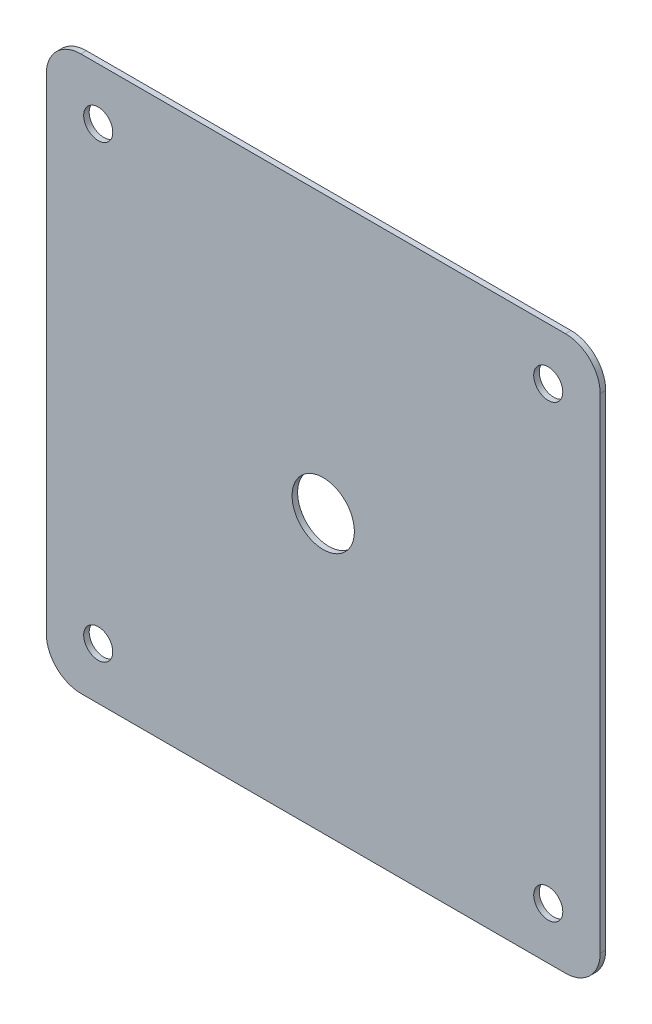
ISO-10303-21;
HEADER;
FILE_DESCRIPTION(('STEP AP214'),'2;1');
FILE_NAME('part.step','',(''),(''),'','','');
FILE_SCHEMA(('AUTOMOTIVE_DESIGN { 1 0 10303 214 1 1 1 1 }'));
ENDSEC;
DATA;
#1=APPLICATION_CONTEXT('core data for automotive mechanical design processes');
#2=APPLICATION_PROTOCOL_DEFINITION('international standard','automotive_design',2000,#1);
#3=PRODUCT_CONTEXT('',#1,'mechanical');
#4=PRODUCT('Part','Part','',(#3));
#5=PRODUCT_RELATED_PRODUCT_CATEGORY('part','',(#4));
#6=PRODUCT_DEFINITION_FORMATION('','',#4);
#7=PRODUCT_DEFINITION_CONTEXT('part definition',#1,'design');
#8=PRODUCT_DEFINITION('design','',#6,#7);
#9=PRODUCT_DEFINITION_SHAPE('','',#8);
#10=(LENGTH_UNIT() NAMED_UNIT(*) SI_UNIT(.MILLI.,.METRE.));
#11=(NAMED_UNIT(*) PLANE_ANGLE_UNIT() SI_UNIT($,.RADIAN.));
#12=(NAMED_UNIT(*) SI_UNIT($,.STERADIAN.) SOLID_ANGLE_UNIT());
#13=UNCERTAINTY_MEASURE_WITH_UNIT(LENGTH_MEASURE(1.E-05),#10,'distance_accuracy_value','');
#14=(GEOMETRIC_REPRESENTATION_CONTEXT(3) GLOBAL_UNCERTAINTY_ASSIGNED_CONTEXT((#13)) GLOBAL_UNIT_ASSIGNED_CONTEXT((#10,
#11,#12)) REPRESENTATION_CONTEXT('',''));
#15=CARTESIAN_POINT('',(0.,0.,0.));
#16=DIRECTION('',(0.,0.,1.));
#17=DIRECTION('',(1.,0.,0.));
#18=AXIS2_PLACEMENT_3D('',#15,#16,#17);
#19=CARTESIAN_POINT('',(-40.,40.,-0.8));
#20=DIRECTION('',(-1.,0.,0.));
#21=DIRECTION('',(0.,-1.,0.));
#22=AXIS2_PLACEMENT_3D('',#19,#20,#21);
#23=PLANE('',#22);
#24=DIRECTION('',(0.,-1.,0.));
#25=VECTOR('',#24,1.);
#26=CARTESIAN_POINT('',(-40.,40.,0.));
#27=LINE('',#26,#25);
#28=CARTESIAN_POINT('',(-40.,35.,0.));
#29=VERTEX_POINT('',#28);
#30=CARTESIAN_POINT('',(-40.,-35.,0.));
#31=VERTEX_POINT('',#30);
#32=EDGE_CURVE('E161',#29,#31,#27,.T.);
#33=ORIENTED_EDGE('',*,*,#32,.F.);
#34=DIRECTION('',(0.,0.,1.));
#35=VECTOR('',#34,1.);
#36=CARTESIAN_POINT('',(-40.,35.,-0.8));
#37=LINE('',#36,#35);
#38=CARTESIAN_POINT('',(-40.,35.,-0.8));
#39=VERTEX_POINT('',#38);
#40=EDGE_CURVE('E141',#29,#39,#37,.F.);
#41=ORIENTED_EDGE('',*,*,#40,.T.);
#42=DIRECTION('',(0.,-1.,0.));
#43=VECTOR('',#42,1.);
#44=CARTESIAN_POINT('',(-40.,40.,-0.8));
#45=LINE('',#44,#43);
#46=CARTESIAN_POINT('',(-40.,-35.,-0.8));
#47=VERTEX_POINT('',#46);
#48=EDGE_CURVE('E122',#39,#47,#45,.T.);
#49=ORIENTED_EDGE('',*,*,#48,.T.);
#50=DIRECTION('',(0.,0.,1.));
#51=VECTOR('',#50,1.);
#52=CARTESIAN_POINT('',(-40.,-35.,-0.8));
#53=LINE('',#52,#51);
#54=EDGE_CURVE('E138',#47,#31,#53,.T.);
#55=ORIENTED_EDGE('',*,*,#54,.T.);
#56=EDGE_LOOP('',(#33,#41,#49,#55));
#57=FACE_BOUND('',#56,.T.);
#58=ADVANCED_FACE('F36',(#57),#23,.T.);
#59=CARTESIAN_POINT('',(40.,40.,-0.8));
#60=DIRECTION('',(0.,1.,0.));
#61=DIRECTION('',(-1.,0.,0.));
#62=AXIS2_PLACEMENT_3D('',#59,#60,#61);
#63=PLANE('',#62);
#64=DIRECTION('',(-1.,0.,0.));
#65=VECTOR('',#64,1.);
#66=CARTESIAN_POINT('',(40.,40.,-0.8));
#67=LINE('',#66,#65);
#68=CARTESIAN_POINT('',(35.,40.,-0.8));
#69=VERTEX_POINT('',#68);
#70=CARTESIAN_POINT('',(-35.,40.,-0.8));
#71=VERTEX_POINT('',#70);
#72=EDGE_CURVE('E126',#69,#71,#67,.T.);
#73=ORIENTED_EDGE('',*,*,#72,.T.);
#74=DIRECTION('',(0.,0.,1.));
#75=VECTOR('',#74,1.);
#76=CARTESIAN_POINT('',(-35.,40.,-0.8));
#77=LINE('',#76,#75);
#78=CARTESIAN_POINT('',(-35.,40.,0.));
#79=VERTEX_POINT('',#78);
#80=EDGE_CURVE('E113',#71,#79,#77,.T.);
#81=ORIENTED_EDGE('',*,*,#80,.T.);
#82=DIRECTION('',(-1.,0.,0.));
#83=VECTOR('',#82,1.);
#84=CARTESIAN_POINT('',(40.,40.,0.));
#85=LINE('',#84,#83);
#86=CARTESIAN_POINT('',(35.,40.,0.));
#87=VERTEX_POINT('',#86);
#88=EDGE_CURVE('E105',#87,#79,#85,.T.);
#89=ORIENTED_EDGE('',*,*,#88,.F.);
#90=DIRECTION('',(0.,0.,1.));
#91=VECTOR('',#90,1.);
#92=CARTESIAN_POINT('',(35.,40.,-0.8));
#93=LINE('',#92,#91);
#94=EDGE_CURVE('E119',#87,#69,#93,.F.);
#95=ORIENTED_EDGE('',*,*,#94,.T.);
#96=EDGE_LOOP('',(#73,#81,#89,#95));
#97=FACE_BOUND('',#96,.T.);
#98=ADVANCED_FACE('F118',(#97),#63,.T.);
#99=CARTESIAN_POINT('',(40.,40.,-0.8));
#100=DIRECTION('',(1.,0.,0.));
#101=DIRECTION('',(0.,1.,0.));
#102=AXIS2_PLACEMENT_3D('',#99,#100,#101);
#103=PLANE('',#102);
#104=DIRECTION('',(0.,1.,0.));
#105=VECTOR('',#104,1.);
#106=CARTESIAN_POINT('',(40.,40.,0.));
#107=LINE('',#106,#105);
#108=CARTESIAN_POINT('',(40.,-35.,0.));
#109=VERTEX_POINT('',#108);
#110=CARTESIAN_POINT('',(40.,35.,0.));
#111=VERTEX_POINT('',#110);
#112=EDGE_CURVE('E107',#109,#111,#107,.T.);
#113=ORIENTED_EDGE('',*,*,#112,.F.);
#114=DIRECTION('',(0.,0.,1.));
#115=VECTOR('',#114,1.);
#116=CARTESIAN_POINT('',(40.,-35.,-0.8));
#117=LINE('',#116,#115);
#118=CARTESIAN_POINT('',(40.,-35.,-0.8));
#119=VERTEX_POINT('',#118);
#120=EDGE_CURVE('E11',#109,#119,#117,.F.);
#121=ORIENTED_EDGE('',*,*,#120,.T.);
#122=DIRECTION('',(0.,1.,0.));
#123=VECTOR('',#122,1.);
#124=CARTESIAN_POINT('',(40.,40.,-0.8));
#125=LINE('',#124,#123);
#126=CARTESIAN_POINT('',(40.,35.,-0.8));
#127=VERTEX_POINT('',#126);
#128=EDGE_CURVE('E129',#119,#127,#125,.T.);
#129=ORIENTED_EDGE('',*,*,#128,.T.);
#130=DIRECTION('',(0.,0.,1.));
#131=VECTOR('',#130,1.);
#132=CARTESIAN_POINT('',(40.,35.,-0.8));
#133=LINE('',#132,#131);
#134=EDGE_CURVE('E44',#127,#111,#133,.T.);
#135=ORIENTED_EDGE('',*,*,#134,.T.);
#136=EDGE_LOOP('',(#113,#121,#129,#135));
#137=FACE_BOUND('',#136,.T.);
#138=ADVANCED_FACE('F154',(#137),#103,.T.);
#139=CARTESIAN_POINT('',(40.,-40.,-0.8));
#140=DIRECTION('',(0.,-1.,0.));
#141=DIRECTION('',(0.,0.,-1.));
#142=AXIS2_PLACEMENT_3D('',#139,#140,#141);
#143=PLANE('',#142);
#144=DIRECTION('',(1.,0.,0.));
#145=VECTOR('',#144,1.);
#146=CARTESIAN_POINT('',(40.,-40.,0.));
#147=LINE('',#146,#145);
#148=CARTESIAN_POINT('',(-35.,-40.,0.));
#149=VERTEX_POINT('',#148);
#150=CARTESIAN_POINT('',(35.,-40.,0.));
#151=VERTEX_POINT('',#150);
#152=EDGE_CURVE('E164',#149,#151,#147,.T.);
#153=ORIENTED_EDGE('',*,*,#152,.F.);
#154=DIRECTION('',(0.,0.,1.));
#155=VECTOR('',#154,1.);
#156=CARTESIAN_POINT('',(-35.,-40.,-0.8));
#157=LINE('',#156,#155);
#158=CARTESIAN_POINT('',(-35.,-40.,-0.8));
#159=VERTEX_POINT('',#158);
#160=EDGE_CURVE('E58',#149,#159,#157,.F.);
#161=ORIENTED_EDGE('',*,*,#160,.T.);
#162=DIRECTION('',(1.,0.,0.));
#163=VECTOR('',#162,1.);
#164=CARTESIAN_POINT('',(40.,-40.,-0.8));
#165=LINE('',#164,#163);
#166=CARTESIAN_POINT('',(35.,-40.,-0.8));
#167=VERTEX_POINT('',#166);
#168=EDGE_CURVE('E156',#159,#167,#165,.T.);
#169=ORIENTED_EDGE('',*,*,#168,.T.);
#170=DIRECTION('',(0.,0.,1.));
#171=VECTOR('',#170,1.);
#172=CARTESIAN_POINT('',(35.,-40.,-0.8));
#173=LINE('',#172,#171);
#174=EDGE_CURVE('E149',#167,#151,#173,.T.);
#175=ORIENTED_EDGE('',*,*,#174,.T.);
#176=EDGE_LOOP('',(#153,#161,#169,#175));
#177=FACE_BOUND('',#176,.T.);
#178=ADVANCED_FACE('F167',(#177),#143,.T.);
#179=CARTESIAN_POINT('',(0.,0.,-0.8));
#180=DIRECTION('',(0.,0.,-1.));
#181=DIRECTION('',(-1.,0.,0.));
#182=AXIS2_PLACEMENT_3D('',#179,#180,#181);
#183=PLANE('',#182);
#184=CARTESIAN_POINT('',(-32.4999999999986,-32.5,-0.8));
#185=DIRECTION('',(0.,0.,1.));
#186=DIRECTION('',(1.,0.,0.));
#187=AXIS2_PLACEMENT_3D('',#184,#185,#186);
#188=CIRCLE('',#187,2.1);
#189=CARTESIAN_POINT('',(-30.3999999999986,-32.5,-0.8));
#190=VERTEX_POINT('',#189);
#191=EDGE_CURVE('E202',#190,#190,#188,.T.);
#192=ORIENTED_EDGE('',*,*,#191,.T.);
#193=EDGE_LOOP('',(#192));
#194=FACE_BOUND('',#193,.T.);
#195=CARTESIAN_POINT('',(32.5000000000014,-32.4999999999986,-0.8));
#196=DIRECTION('',(0.,0.,1.));
#197=DIRECTION('',(1.,0.,0.));
#198=AXIS2_PLACEMENT_3D('',#195,#196,#197);
#199=CIRCLE('',#198,2.1);
#200=CARTESIAN_POINT('',(34.6000000000014,-32.4999999999986,-0.8));
#201=VERTEX_POINT('',#200);
#202=EDGE_CURVE('E196',#201,#201,#199,.T.);
#203=ORIENTED_EDGE('',*,*,#202,.T.);
#204=EDGE_LOOP('',(#203));
#205=FACE_BOUND('',#204,.T.);
#206=CARTESIAN_POINT('',(32.5,32.5000000000014,-0.8));
#207=DIRECTION('',(0.,0.,1.));
#208=DIRECTION('',(1.,0.,0.));
#209=AXIS2_PLACEMENT_3D('',#206,#207,#208);
#210=CIRCLE('',#209,2.1);
#211=CARTESIAN_POINT('',(34.6,32.5000000000014,-0.8));
#212=VERTEX_POINT('',#211);
#213=EDGE_CURVE('E190',#212,#212,#210,.T.);
#214=ORIENTED_EDGE('',*,*,#213,.T.);
#215=EDGE_LOOP('',(#214));
#216=FACE_BOUND('',#215,.T.);
#217=CARTESIAN_POINT('',(-32.5,32.5,-0.8));
#218=DIRECTION('',(0.,0.,1.));
#219=DIRECTION('',(1.,0.,0.));
#220=AXIS2_PLACEMENT_3D('',#217,#218,#219);
#221=CIRCLE('',#220,2.1);
#222=CARTESIAN_POINT('',(-30.4,32.5,-0.8));
#223=VERTEX_POINT('',#222);
#224=EDGE_CURVE('E184',#223,#223,#221,.T.);
#225=ORIENTED_EDGE('',*,*,#224,.T.);
#226=EDGE_LOOP('',(#225));
#227=FACE_BOUND('',#226,.T.);
#228=CARTESIAN_POINT('',(0.,0.,-0.8));
#229=DIRECTION('',(0.,0.,1.));
#230=DIRECTION('',(1.,0.,0.));
#231=AXIS2_PLACEMENT_3D('',#228,#229,#230);
#232=CIRCLE('',#231,4.5);
#233=CARTESIAN_POINT('',(4.50000000000001,0.,-0.8));
#234=VERTEX_POINT('',#233);
#235=EDGE_CURVE('E165',#234,#234,#232,.T.);
#236=ORIENTED_EDGE('',*,*,#235,.T.);
#237=EDGE_LOOP('',(#236));
#238=FACE_BOUND('',#237,.T.);
#239=ORIENTED_EDGE('',*,*,#48,.F.);
#240=CARTESIAN_POINT('',(-35.,35.,-0.8));
#241=DIRECTION('',(0.,0.,-1.));
#242=DIRECTION('',(-1.,0.,0.));
#243=AXIS2_PLACEMENT_3D('',#240,#241,#242);
#244=CIRCLE('',#243,5.);
#245=EDGE_CURVE('E147',#39,#71,#244,.T.);
#246=ORIENTED_EDGE('',*,*,#245,.T.);
#247=ORIENTED_EDGE('',*,*,#72,.F.);
#248=CARTESIAN_POINT('',(35.,35.,-0.8));
#249=DIRECTION('',(0.,0.,-1.));
#250=DIRECTION('',(-1.,0.,0.));
#251=AXIS2_PLACEMENT_3D('',#248,#249,#250);
#252=CIRCLE('',#251,5.);
#253=EDGE_CURVE('E125',#69,#127,#252,.T.);
#254=ORIENTED_EDGE('',*,*,#253,.T.);
#255=ORIENTED_EDGE('',*,*,#128,.F.);
#256=CARTESIAN_POINT('',(35.,-35.,-0.8));
#257=DIRECTION('',(0.,0.,-1.));
#258=DIRECTION('',(-1.,0.,0.));
#259=AXIS2_PLACEMENT_3D('',#256,#257,#258);
#260=CIRCLE('',#259,5.);
#261=EDGE_CURVE('E51',#119,#167,#260,.T.);
#262=ORIENTED_EDGE('',*,*,#261,.T.);
#263=ORIENTED_EDGE('',*,*,#168,.F.);
#264=CARTESIAN_POINT('',(-35.,-35.,-0.8));
#265=DIRECTION('',(0.,0.,-1.));
#266=DIRECTION('',(-1.,0.,0.));
#267=AXIS2_PLACEMENT_3D('',#264,#265,#266);
#268=CIRCLE('',#267,5.);
#269=EDGE_CURVE('E145',#159,#47,#268,.T.);
#270=ORIENTED_EDGE('',*,*,#269,.T.);
#271=EDGE_LOOP('',(#239,#246,#247,#254,#255,#262,#263,#270));
#272=FACE_BOUND('',#271,.T.);
#273=ADVANCED_FACE('F175',(#194,#205,#216,#227,#238,#272),#183,.T.);
#274=CARTESIAN_POINT('',(0.,0.,0.));
#275=DIRECTION('',(0.,0.,-1.));
#276=DIRECTION('',(-1.,0.,0.));
#277=AXIS2_PLACEMENT_3D('',#274,#275,#276);
#278=PLANE('',#277);
#279=CARTESIAN_POINT('',(-32.4999999999986,-32.5,0.));
#280=DIRECTION('',(0.,0.,1.));
#281=DIRECTION('',(1.,0.,0.));
#282=AXIS2_PLACEMENT_3D('',#279,#280,#281);
#283=CIRCLE('',#282,2.1);
#284=CARTESIAN_POINT('',(-30.3999999999986,-32.5,0.));
#285=VERTEX_POINT('',#284);
#286=EDGE_CURVE('E205',#285,#285,#283,.T.);
#287=ORIENTED_EDGE('',*,*,#286,.F.);
#288=EDGE_LOOP('',(#287));
#289=FACE_BOUND('',#288,.T.);
#290=CARTESIAN_POINT('',(32.5000000000014,-32.4999999999986,0.));
#291=DIRECTION('',(0.,0.,1.));
#292=DIRECTION('',(1.,0.,0.));
#293=AXIS2_PLACEMENT_3D('',#290,#291,#292);
#294=CIRCLE('',#293,2.1);
#295=CARTESIAN_POINT('',(34.6000000000014,-32.4999999999986,0.));
#296=VERTEX_POINT('',#295);
#297=EDGE_CURVE('E199',#296,#296,#294,.T.);
#298=ORIENTED_EDGE('',*,*,#297,.F.);
#299=EDGE_LOOP('',(#298));
#300=FACE_BOUND('',#299,.T.);
#301=CARTESIAN_POINT('',(32.5,32.5000000000014,0.));
#302=DIRECTION('',(0.,0.,1.));
#303=DIRECTION('',(1.,0.,0.));
#304=AXIS2_PLACEMENT_3D('',#301,#302,#303);
#305=CIRCLE('',#304,2.1);
#306=CARTESIAN_POINT('',(34.6,32.5000000000014,0.));
#307=VERTEX_POINT('',#306);
#308=EDGE_CURVE('E193',#307,#307,#305,.T.);
#309=ORIENTED_EDGE('',*,*,#308,.F.);
#310=EDGE_LOOP('',(#309));
#311=FACE_BOUND('',#310,.T.);
#312=CARTESIAN_POINT('',(-32.5,32.5,0.));
#313=DIRECTION('',(0.,0.,1.));
#314=DIRECTION('',(1.,0.,0.));
#315=AXIS2_PLACEMENT_3D('',#312,#313,#314);
#316=CIRCLE('',#315,2.1);
#317=CARTESIAN_POINT('',(-30.4,32.5,0.));
#318=VERTEX_POINT('',#317);
#319=EDGE_CURVE('E187',#318,#318,#316,.T.);
#320=ORIENTED_EDGE('',*,*,#319,.F.);
#321=EDGE_LOOP('',(#320));
#322=FACE_BOUND('',#321,.T.);
#323=CARTESIAN_POINT('',(0.,0.,0.));
#324=DIRECTION('',(0.,0.,1.));
#325=DIRECTION('',(1.,0.,0.));
#326=AXIS2_PLACEMENT_3D('',#323,#324,#325);
#327=CIRCLE('',#326,4.5);
#328=CARTESIAN_POINT('',(4.50000000000001,0.,0.));
#329=VERTEX_POINT('',#328);
#330=EDGE_CURVE('E181',#329,#329,#327,.T.);
#331=ORIENTED_EDGE('',*,*,#330,.F.);
#332=EDGE_LOOP('',(#331));
#333=FACE_BOUND('',#332,.T.);
#334=ORIENTED_EDGE('',*,*,#88,.T.);
#335=CARTESIAN_POINT('',(-35.,35.,0.));
#336=DIRECTION('',(0.,0.,-1.));
#337=DIRECTION('',(-1.,0.,0.));
#338=AXIS2_PLACEMENT_3D('',#335,#336,#337);
#339=CIRCLE('',#338,5.);
#340=EDGE_CURVE('E136',#79,#29,#339,.F.);
#341=ORIENTED_EDGE('',*,*,#340,.T.);
#342=ORIENTED_EDGE('',*,*,#32,.T.);
#343=CARTESIAN_POINT('',(-35.,-35.,0.));
#344=DIRECTION('',(0.,0.,-1.));
#345=DIRECTION('',(-1.,0.,0.));
#346=AXIS2_PLACEMENT_3D('',#343,#344,#345);
#347=CIRCLE('',#346,5.);
#348=EDGE_CURVE('E134',#31,#149,#347,.F.);
#349=ORIENTED_EDGE('',*,*,#348,.T.);
#350=ORIENTED_EDGE('',*,*,#152,.T.);
#351=CARTESIAN_POINT('',(35.,-35.,0.));
#352=DIRECTION('',(0.,0.,-1.));
#353=DIRECTION('',(-1.,0.,0.));
#354=AXIS2_PLACEMENT_3D('',#351,#352,#353);
#355=CIRCLE('',#354,5.);
#356=EDGE_CURVE('E112',#151,#109,#355,.F.);
#357=ORIENTED_EDGE('',*,*,#356,.T.);
#358=ORIENTED_EDGE('',*,*,#112,.T.);
#359=CARTESIAN_POINT('',(35.,35.,0.));
#360=DIRECTION('',(0.,0.,-1.));
#361=DIRECTION('',(-1.,0.,0.));
#362=AXIS2_PLACEMENT_3D('',#359,#360,#361);
#363=CIRCLE('',#362,5.);
#364=EDGE_CURVE('E102',#111,#87,#363,.F.);
#365=ORIENTED_EDGE('',*,*,#364,.T.);
#366=EDGE_LOOP('',(#334,#341,#342,#349,#350,#357,#358,#365));
#367=FACE_BOUND('',#366,.T.);
#368=ADVANCED_FACE('F104',(#289,#300,#311,#322,#333,#367),#278,.F.);
#369=CARTESIAN_POINT('',(0.,0.,-0.8));
#370=DIRECTION('',(0.,0.,1.));
#371=DIRECTION('',(1.,0.,0.));
#372=AXIS2_PLACEMENT_3D('',#369,#370,#371);
#373=CYLINDRICAL_SURFACE('',#372,4.5);
#374=ORIENTED_EDGE('',*,*,#235,.F.);
#375=EDGE_LOOP('',(#374));
#376=FACE_BOUND('',#375,.T.);
#377=ORIENTED_EDGE('',*,*,#330,.T.);
#378=EDGE_LOOP('',(#377));
#379=FACE_BOUND('',#378,.T.);
#380=ADVANCED_FACE('F223',(#376,#379),#373,.F.);
#381=CARTESIAN_POINT('',(-32.5,32.5,-0.8));
#382=DIRECTION('',(0.,0.,1.));
#383=DIRECTION('',(1.,0.,0.));
#384=AXIS2_PLACEMENT_3D('',#381,#382,#383);
#385=CYLINDRICAL_SURFACE('',#384,2.1);
#386=ORIENTED_EDGE('',*,*,#224,.F.);
#387=EDGE_LOOP('',(#386));
#388=FACE_BOUND('',#387,.T.);
#389=ORIENTED_EDGE('',*,*,#319,.T.);
#390=EDGE_LOOP('',(#389));
#391=FACE_BOUND('',#390,.T.);
#392=ADVANCED_FACE('F234',(#388,#391),#385,.F.);
#393=CARTESIAN_POINT('',(32.5,32.5000000000014,-0.8));
#394=DIRECTION('',(0.,0.,1.));
#395=DIRECTION('',(1.,0.,0.));
#396=AXIS2_PLACEMENT_3D('',#393,#394,#395);
#397=CYLINDRICAL_SURFACE('',#396,2.1);
#398=ORIENTED_EDGE('',*,*,#213,.F.);
#399=EDGE_LOOP('',(#398));
#400=FACE_BOUND('',#399,.T.);
#401=ORIENTED_EDGE('',*,*,#308,.T.);
#402=EDGE_LOOP('',(#401));
#403=FACE_BOUND('',#402,.T.);
#404=ADVANCED_FACE('F240',(#400,#403),#397,.F.);
#405=CARTESIAN_POINT('',(32.5000000000014,-32.4999999999986,-0.8));
#406=DIRECTION('',(0.,0.,1.));
#407=DIRECTION('',(1.,0.,0.));
#408=AXIS2_PLACEMENT_3D('',#405,#406,#407);
#409=CYLINDRICAL_SURFACE('',#408,2.1);
#410=ORIENTED_EDGE('',*,*,#202,.F.);
#411=EDGE_LOOP('',(#410));
#412=FACE_BOUND('',#411,.T.);
#413=ORIENTED_EDGE('',*,*,#297,.T.);
#414=EDGE_LOOP('',(#413));
#415=FACE_BOUND('',#414,.T.);
#416=ADVANCED_FACE('F217',(#412,#415),#409,.F.);
#417=CARTESIAN_POINT('',(-32.4999999999986,-32.5,-0.8));
#418=DIRECTION('',(0.,0.,1.));
#419=DIRECTION('',(1.,0.,0.));
#420=AXIS2_PLACEMENT_3D('',#417,#418,#419);
#421=CYLINDRICAL_SURFACE('',#420,2.1);
#422=ORIENTED_EDGE('',*,*,#191,.F.);
#423=EDGE_LOOP('',(#422));
#424=FACE_BOUND('',#423,.T.);
#425=ORIENTED_EDGE('',*,*,#286,.T.);
#426=EDGE_LOOP('',(#425));
#427=FACE_BOUND('',#426,.T.);
#428=ADVANCED_FACE('F213',(#424,#427),#421,.F.);
#429=CARTESIAN_POINT('',(-35.,35.,-0.8));
#430=DIRECTION('',(0.,0.,1.));
#431=DIRECTION('',(1.,0.,0.));
#432=AXIS2_PLACEMENT_3D('',#429,#430,#431);
#433=CYLINDRICAL_SURFACE('',#432,5.);
#434=ORIENTED_EDGE('',*,*,#245,.F.);
#435=ORIENTED_EDGE('',*,*,#40,.F.);
#436=ORIENTED_EDGE('',*,*,#340,.F.);
#437=ORIENTED_EDGE('',*,*,#80,.F.);
#438=EDGE_LOOP('',(#434,#435,#436,#437));
#439=FACE_BOUND('',#438,.T.);
#440=ADVANCED_FACE('F216',(#439),#433,.T.);
#441=CARTESIAN_POINT('',(-35.,-35.,-0.8));
#442=DIRECTION('',(0.,0.,1.));
#443=DIRECTION('',(1.,0.,0.));
#444=AXIS2_PLACEMENT_3D('',#441,#442,#443);
#445=CYLINDRICAL_SURFACE('',#444,5.);
#446=ORIENTED_EDGE('',*,*,#269,.F.);
#447=ORIENTED_EDGE('',*,*,#160,.F.);
#448=ORIENTED_EDGE('',*,*,#348,.F.);
#449=ORIENTED_EDGE('',*,*,#54,.F.);
#450=EDGE_LOOP('',(#446,#447,#448,#449));
#451=FACE_BOUND('',#450,.T.);
#452=ADVANCED_FACE('F171',(#451),#445,.T.);
#453=CARTESIAN_POINT('',(35.,-35.,-0.8));
#454=DIRECTION('',(0.,0.,1.));
#455=DIRECTION('',(1.,0.,0.));
#456=AXIS2_PLACEMENT_3D('',#453,#454,#455);
#457=CYLINDRICAL_SURFACE('',#456,5.);
#458=ORIENTED_EDGE('',*,*,#261,.F.);
#459=ORIENTED_EDGE('',*,*,#120,.F.);
#460=ORIENTED_EDGE('',*,*,#356,.F.);
#461=ORIENTED_EDGE('',*,*,#174,.F.);
#462=EDGE_LOOP('',(#458,#459,#460,#461));
#463=FACE_BOUND('',#462,.T.);
#464=ADVANCED_FACE('F258',(#463),#457,.T.);
#465=CARTESIAN_POINT('',(35.,35.,-0.8));
#466=DIRECTION('',(0.,0.,1.));
#467=DIRECTION('',(1.,0.,0.));
#468=AXIS2_PLACEMENT_3D('',#465,#466,#467);
#469=CYLINDRICAL_SURFACE('',#468,5.);
#470=ORIENTED_EDGE('',*,*,#253,.F.);
#471=ORIENTED_EDGE('',*,*,#94,.F.);
#472=ORIENTED_EDGE('',*,*,#364,.F.);
#473=ORIENTED_EDGE('',*,*,#134,.F.);
#474=EDGE_LOOP('',(#470,#471,#472,#473));
#475=FACE_BOUND('',#474,.T.);
#476=ADVANCED_FACE('F38',(#475),#469,.T.);
#477=CLOSED_SHELL('',(#58,#98,#138,#178,#273,#368,#380,#392,#404,#416,#428,#440,#452,#464,#476));
#478=MANIFOLD_SOLID_BREP('B2',#477);
#479=ADVANCED_BREP_SHAPE_REPRESENTATION('',(#18,#478),#14);
#480=SHAPE_DEFINITION_REPRESENTATION(#9,#479);
ENDSEC;
END-ISO-10303-21;
